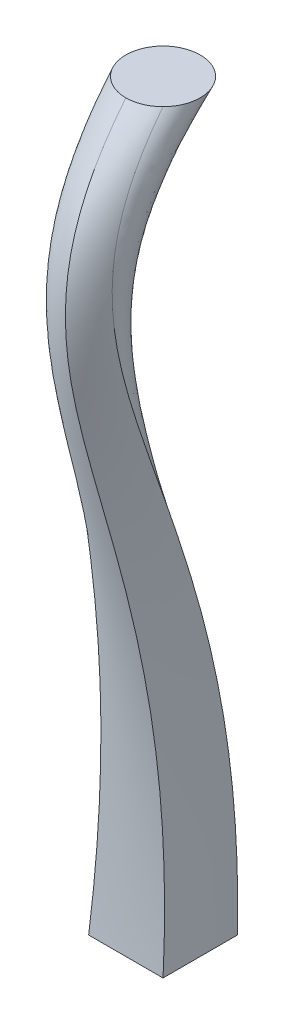
ISO-10303-21;
HEADER;
FILE_DESCRIPTION(('STEP AP214'),'2;1');
FILE_NAME('part.step','',(''),(''),'','','');
FILE_SCHEMA(('AUTOMOTIVE_DESIGN { 1 0 10303 214 1 1 1 1 }'));
ENDSEC;
DATA;
#1=APPLICATION_CONTEXT('core data for automotive mechanical design processes');
#2=APPLICATION_PROTOCOL_DEFINITION('international standard','automotive_design',2000,#1);
#3=PRODUCT_CONTEXT('',#1,'mechanical');
#4=PRODUCT('Part','Part','',(#3));
#5=PRODUCT_RELATED_PRODUCT_CATEGORY('part','',(#4));
#6=PRODUCT_DEFINITION_FORMATION('','',#4);
#7=PRODUCT_DEFINITION_CONTEXT('part definition',#1,'design');
#8=PRODUCT_DEFINITION('design','',#6,#7);
#9=PRODUCT_DEFINITION_SHAPE('','',#8);
#10=(LENGTH_UNIT() NAMED_UNIT(*) SI_UNIT(.MILLI.,.METRE.));
#11=(NAMED_UNIT(*) PLANE_ANGLE_UNIT() SI_UNIT($,.RADIAN.));
#12=(NAMED_UNIT(*) SI_UNIT($,.STERADIAN.) SOLID_ANGLE_UNIT());
#13=UNCERTAINTY_MEASURE_WITH_UNIT(LENGTH_MEASURE(1.E-05),#10,'distance_accuracy_value','');
#14=(GEOMETRIC_REPRESENTATION_CONTEXT(3) GLOBAL_UNCERTAINTY_ASSIGNED_CONTEXT((#13)) GLOBAL_UNIT_ASSIGNED_CONTEXT((#10,
#11,#12)) REPRESENTATION_CONTEXT('',''));
#15=CARTESIAN_POINT('',(0.,0.,0.));
#16=DIRECTION('',(0.,0.,1.));
#17=DIRECTION('',(1.,0.,0.));
#18=AXIS2_PLACEMENT_3D('',#15,#16,#17);
#19=CARTESIAN_POINT('',(0.,0.,0.));
#20=DIRECTION('',(0.,-1.,0.));
#21=DIRECTION('',(0.,0.,-1.));
#22=AXIS2_PLACEMENT_3D('',#19,#20,#21);
#23=PLANE('',#22);
#24=DIRECTION('',(0.,0.,1.));
#25=VECTOR('',#24,1.);
#26=CARTESIAN_POINT('',(-5.,0.,-5.));
#27=LINE('',#26,#25);
#28=CARTESIAN_POINT('',(-5.,0.,-5.));
#29=VERTEX_POINT('',#28);
#30=CARTESIAN_POINT('',(-5.,0.,5.));
#31=VERTEX_POINT('',#30);
#32=EDGE_CURVE('E224',#29,#31,#27,.T.);
#33=ORIENTED_EDGE('',*,*,#32,.F.);
#34=DIRECTION('',(-1.,0.,0.));
#35=VECTOR('',#34,1.);
#36=CARTESIAN_POINT('',(5.,0.,-5.));
#37=LINE('',#36,#35);
#38=CARTESIAN_POINT('',(5.,0.,-5.));
#39=VERTEX_POINT('',#38);
#40=EDGE_CURVE('E13',#39,#29,#37,.T.);
#41=ORIENTED_EDGE('',*,*,#40,.F.);
#42=DIRECTION('',(0.,0.,-1.));
#43=VECTOR('',#42,1.);
#44=CARTESIAN_POINT('',(5.,0.,-5.));
#45=LINE('',#44,#43);
#46=CARTESIAN_POINT('',(5.,0.,5.));
#47=VERTEX_POINT('',#46);
#48=EDGE_CURVE('E107',#47,#39,#45,.T.);
#49=ORIENTED_EDGE('',*,*,#48,.F.);
#50=DIRECTION('',(1.,0.,0.));
#51=VECTOR('',#50,1.);
#52=CARTESIAN_POINT('',(5.,0.,5.));
#53=LINE('',#52,#51);
#54=EDGE_CURVE('E297',#31,#47,#53,.T.);
#55=ORIENTED_EDGE('',*,*,#54,.F.);
#56=EDGE_LOOP('',(#33,#41,#49,#55));
#57=FACE_BOUND('',#56,.T.);
#58=ADVANCED_FACE('F97',(#57),#23,.T.);
#59=CARTESIAN_POINT('',(0.,100.,0.));
#60=DIRECTION('',(0.,1.,0.));
#61=DIRECTION('',(0.,0.,1.));
#62=AXIS2_PLACEMENT_3D('',#59,#60,#61);
#63=PLANE('',#62);
#64=CARTESIAN_POINT('',(0.,100.,0.));
#65=DIRECTION('',(0.,1.,0.));
#66=DIRECTION('',(0.,0.,1.));
#67=AXIS2_PLACEMENT_3D('',#64,#65,#66);
#68=CIRCLE('',#67,5.);
#69=CARTESIAN_POINT('',(3.53553390593274,100.,3.53553390593274));
#70=VERTEX_POINT('',#69);
#71=CARTESIAN_POINT('',(3.53553390593274,100.,-3.53553390593274));
#72=VERTEX_POINT('',#71);
#73=EDGE_CURVE('E154',#70,#72,#68,.T.);
#74=ORIENTED_EDGE('',*,*,#73,.T.);
#75=CARTESIAN_POINT('',(-3.53553390593274,100.,-3.53553390593274));
#76=VERTEX_POINT('',#75);
#77=EDGE_CURVE('E160',#72,#76,#68,.T.);
#78=ORIENTED_EDGE('',*,*,#77,.T.);
#79=CARTESIAN_POINT('',(0.,100.,5.));
#80=VERTEX_POINT('',#79);
#81=EDGE_CURVE('E167',#76,#80,#68,.T.);
#82=ORIENTED_EDGE('',*,*,#81,.T.);
#83=EDGE_CURVE('E147',#80,#70,#68,.T.);
#84=ORIENTED_EDGE('',*,*,#83,.T.);
#85=EDGE_LOOP('',(#74,#78,#82,#84));
#86=FACE_BOUND('',#85,.T.);
#87=ADVANCED_FACE('F165',(#86),#63,.T.);
#88=CARTESIAN_POINT('',(3.53553390593274,100.,3.53553390593274));
#89=CARTESIAN_POINT('',(4.02368927062183,74.7211062169845,24.367413158574));
#90=CARTESIAN_POINT('',(4.51184463531091,56.3040519453106,-6.78929293335356));
#91=CARTESIAN_POINT('',(5.,0.,-5.));
#92=CARTESIAN_POINT('',(3.304133755715,100.,3.76693405615047));
#93=CARTESIAN_POINT('',(3.86942250381,74.7211062169845,24.7994577031636));
#94=CARTESIAN_POINT('',(4.434711251905,56.3040519453106,-6.15660399439209));
#95=CARTESIAN_POINT('',(5.,0.,-4.16666666666667));
#96=CARTESIAN_POINT('',(2.79577081197192,100.,4.1841623596009));
#97=CARTESIAN_POINT('',(3.53051387464795,74.7211062169846,25.6331654610195));
#98=CARTESIAN_POINT('',(4.26525693732398,56.3040519453107,-4.90641678213084));
#99=CARTESIAN_POINT('',(5.00000000000001,0.,-2.5));
#100=CARTESIAN_POINT('',(1.92575275637179,99.9999999999998,4.64917842221016));
#101=CARTESIAN_POINT('',(2.95050183758119,74.7211062169843,26.776509502759));
#102=CARTESIAN_POINT('',(3.97525091879059,56.3040519453105,-3.08474476126109));
#103=CARTESIAN_POINT('',(4.99999999999999,0.,0.));
#104=CARTESIAN_POINT('',(0.981741078270542,100.,4.93555807784807));
#105=CARTESIAN_POINT('',(2.32116071884703,74.7211062169845,27.8007626065176));
#106=CARTESIAN_POINT('',(3.66058035942352,56.3040519453106,-1.32261820938179));
#107=CARTESIAN_POINT('',(5.00000000000001,0.,2.5));
#108=CARTESIAN_POINT('',(0.327249230773094,100.,5.));
#109=CARTESIAN_POINT('',(1.8848328205154,74.7211062169845,28.3992794435078));
#110=CARTESIAN_POINT('',(3.4424164102577,56.3040519453106,-0.190026457553365));
#111=CARTESIAN_POINT('',(5.,0.,4.16666666666667));
#112=CARTESIAN_POINT('',(0.,100.,5.));
#113=CARTESIAN_POINT('',(1.66666666666667,74.7211062169845,28.6770572212855));
#114=CARTESIAN_POINT('',(3.33333333333333,56.3040519453106,0.365529098002191));
#115=CARTESIAN_POINT('',(5.,0.,5.));
#116=B_SPLINE_SURFACE_WITH_KNOTS('',3,3,((#88,#89,#90,#91),(#92,#93,#94,#95),(#96,#97,#98,#99),
(#100,#101,#102,#103),(#104,#105,#106,#107),(#108,#109,#110,#111),(#112,#113,#114,#115)),
.UNSPECIFIED.,.F.,.F.,.F.,(4,1,1,1,4),(4,4),(0.8125,0.859375,0.90625,0.953125,1.),(0.,1.),.UNSPECIFIED.);
#117=CARTESIAN_POINT('',(0.,100.,5.));
#118=CARTESIAN_POINT('',(1.66666666666667,74.7211062169845,28.6770572212855));
#119=CARTESIAN_POINT('',(3.33333333333333,56.3040519453106,0.365529098002192));
#120=CARTESIAN_POINT('',(5.,0.,5.));
#121=B_SPLINE_CURVE_WITH_KNOTS('',3,(#117,#118,#119,#120),.UNSPECIFIED.,.F.,.F.,(4,4),(0.,1.),.UNSPECIFIED.);
#122=EDGE_CURVE('E152',#80,#47,#121,.T.);
#123=CARTESIAN_POINT('',(3.53553390593274,100.,3.53553390593274));
#124=CARTESIAN_POINT('',(4.02368927062183,74.7211062169845,24.367413158574));
#125=CARTESIAN_POINT('',(4.51184463531091,56.3040519453106,-6.78929293335356));
#126=CARTESIAN_POINT('',(5.,0.,-5.));
#127=B_SPLINE_CURVE_WITH_KNOTS('',3,(#123,#124,#125,#126),.UNSPECIFIED.,.F.,.F.,(4,4),(0.,1.),.UNSPECIFIED.);
#128=EDGE_CURVE('E142',#70,#39,#127,.T.);
#129=ORIENTED_EDGE('',*,*,#83,.F.);
#130=ORIENTED_EDGE('',*,*,#122,.T.);
#131=ORIENTED_EDGE('',*,*,#48,.T.);
#132=ORIENTED_EDGE('',*,*,#128,.F.);
#133=EDGE_LOOP('',(#129,#130,#131,#132));
#134=FACE_BOUND('',#133,.T.);
#135=ADVANCED_FACE('F144',(#134),#116,.T.);
#136=CARTESIAN_POINT('',(3.53553390593274,100.,-3.53553390593274));
#137=CARTESIAN_POINT('',(0.690355937288491,74.7211062169845,19.6533679506637));
#138=CARTESIAN_POINT('',(-2.15482203135575,56.3040519453106,-9.14631553730872));
#139=CARTESIAN_POINT('',(-5.,0.,-5.));
#140=CARTESIAN_POINT('',(3.99833420897964,100.,-3.07273360288584));
#141=CARTESIAN_POINT('',(1.27666725043087,74.7211062169845,19.9619014860283));
#142=CARTESIAN_POINT('',(-1.4449997081179,56.3040519453106,-8.99204876962642));
#143=CARTESIAN_POINT('',(-4.16666666666667,0.,-5.));
#144=CARTESIAN_POINT('',(4.73989736182588,100.,-1.96340426093218));
#145=CARTESIAN_POINT('',(2.32659824121726,74.7211062169846,20.7014543806641));
#146=CARTESIAN_POINT('',(-0.0867008793913722,56.3040519453107,-8.62227232230853));
#147=CARTESIAN_POINT('',(-2.5,0.,-5.));
#148=CARTESIAN_POINT('',(5.13028536592106,99.9999999999998,0.));
#149=CARTESIAN_POINT('',(3.42019024394738,74.7211062169843,22.0103905546189));
#150=CARTESIAN_POINT('',(1.71009512197369,56.3040519453105,-7.96780423533114));
#151=CARTESIAN_POINT('',(0.,0.,-5.));
#152=CARTESIAN_POINT('',(4.73989736182589,100.,1.96340426093217));
#153=CARTESIAN_POINT('',(3.99326490788393,74.7211062169845,23.3193267285736));
#154=CARTESIAN_POINT('',(3.24663245394197,56.3040519453106,-7.31333614835375));
#155=CARTESIAN_POINT('',(2.5,0.,-5.));
#156=CARTESIAN_POINT('',(3.99833420897964,100.,3.07273360288584));
#157=CARTESIAN_POINT('',(4.05444502820865,74.7211062169845,24.0588796232094));
#158=CARTESIAN_POINT('',(4.11055584743766,56.3040519453106,-6.94355970103586));
#159=CARTESIAN_POINT('',(4.16666666666667,0.,-5.));
#160=CARTESIAN_POINT('',(3.53553390593274,100.,3.53553390593274));
#161=CARTESIAN_POINT('',(4.02368927062183,74.7211062169845,24.367413158574));
#162=CARTESIAN_POINT('',(4.51184463531091,56.3040519453106,-6.78929293335356));
#163=CARTESIAN_POINT('',(5.,0.,-5.));
#164=B_SPLINE_SURFACE_WITH_KNOTS('',3,3,((#136,#137,#138,#139),(#140,#141,#142,#143),(#144,#145,
#146,#147),(#148,#149,#150,#151),(#152,#153,#154,#155),(#156,#157,#158,#159),(#160,#161,#162,
#163)),.UNSPECIFIED.,.F.,.F.,.F.,(4,1,1,1,4),(4,4),(0.5625,0.625,0.6875,0.75,0.8125),(0.,1.),.UNSPECIFIED.);
#165=CARTESIAN_POINT('',(3.53553390593274,100.,-3.53553390593274));
#166=CARTESIAN_POINT('',(0.690355937288491,74.7211062169845,19.6533679506637));
#167=CARTESIAN_POINT('',(-2.15482203135575,56.3040519453106,-9.14631553730872));
#168=CARTESIAN_POINT('',(-5.,0.,-5.));
#169=B_SPLINE_CURVE_WITH_KNOTS('',3,(#165,#166,#167,#168),.UNSPECIFIED.,.F.,.F.,(4,4),(0.,1.),.UNSPECIFIED.);
#170=EDGE_CURVE('E115',#72,#29,#169,.T.);
#171=ORIENTED_EDGE('',*,*,#73,.F.);
#172=ORIENTED_EDGE('',*,*,#128,.T.);
#173=ORIENTED_EDGE('',*,*,#40,.T.);
#174=ORIENTED_EDGE('',*,*,#170,.F.);
#175=EDGE_LOOP('',(#171,#172,#173,#174));
#176=FACE_BOUND('',#175,.T.);
#177=ADVANCED_FACE('F156',(#176),#164,.T.);
#178=CARTESIAN_POINT('',(-3.53553390593274,100.,-3.53553390593274));
#179=CARTESIAN_POINT('',(-4.02368927062182,74.7211062169845,22.986701283997));
#180=CARTESIAN_POINT('',(-4.51184463531091,56.3040519453106,-2.47964887064205));
#181=CARTESIAN_POINT('',(-5.,0.,5.));
#182=CARTESIAN_POINT('',(-3.07273360288584,100.,-3.99833420897964));
#183=CARTESIAN_POINT('',(-3.71515573525722,74.7211062169845,22.4003899708547));
#184=CARTESIAN_POINT('',(-4.35757786762861,56.3040519453106,-3.18947119387991));
#185=CARTESIAN_POINT('',(-5.,0.,4.16666666666667));
#186=CARTESIAN_POINT('',(-1.96340426093218,100.,-4.73989736182588));
#187=CARTESIAN_POINT('',(-2.97560284062145,74.7211062169844,21.3504589800683));
#188=CARTESIAN_POINT('',(-3.98780142031072,56.3040519453106,-4.54777002260643));
#189=CARTESIAN_POINT('',(-5.,0.,2.5));
#190=CARTESIAN_POINT('',(0.,100.,-5.13028536592107));
#191=CARTESIAN_POINT('',(-1.66666666666667,74.7211062169845,20.2568669773381));
#192=CARTESIAN_POINT('',(-3.33333333333333,56.3040519453106,-6.3445660239715));
#193=CARTESIAN_POINT('',(-5.,0.,0.));
#194=CARTESIAN_POINT('',(1.96340426093217,99.9999999999999,-4.73989736182589));
#195=CARTESIAN_POINT('',(-0.357730492711885,74.7211062169844,19.6837923134016));
#196=CARTESIAN_POINT('',(-2.67886524635594,56.3040519453106,-7.88110335593977));
#197=CARTESIAN_POINT('',(-5.,0.,-2.5));
#198=CARTESIAN_POINT('',(3.07273360288584,100.,-3.99833420897964));
#199=CARTESIAN_POINT('',(0.381822401923891,74.7211062169845,19.6226121930769));
#200=CARTESIAN_POINT('',(-2.30908879903805,56.3040519453106,-8.74502674943546));
#201=CARTESIAN_POINT('',(-5.,0.,-4.16666666666667));
#202=CARTESIAN_POINT('',(3.53553390593274,100.,-3.53553390593274));
#203=CARTESIAN_POINT('',(0.690355937288491,74.7211062169845,19.6533679506637));
#204=CARTESIAN_POINT('',(-2.15482203135575,56.3040519453106,-9.14631553730872));
#205=CARTESIAN_POINT('',(-5.,0.,-5.));
#206=B_SPLINE_SURFACE_WITH_KNOTS('',3,3,((#178,#179,#180,#181),(#182,#183,#184,#185),(#186,#187,
#188,#189),(#190,#191,#192,#193),(#194,#195,#196,#197),(#198,#199,#200,#201),(#202,#203,#204,
#205)),.UNSPECIFIED.,.F.,.F.,.F.,(4,1,1,1,4),(4,4),(0.3125,0.375,0.4375,0.5,0.5625),(0.,1.),.UNSPECIFIED.);
#207=CARTESIAN_POINT('',(-3.53553390593274,100.,-3.53553390593274));
#208=CARTESIAN_POINT('',(-4.02368927062182,74.7211062169845,22.986701283997));
#209=CARTESIAN_POINT('',(-4.51184463531091,56.3040519453106,-2.47964887064205));
#210=CARTESIAN_POINT('',(-5.,0.,5.));
#211=B_SPLINE_CURVE_WITH_KNOTS('',3,(#207,#208,#209,#210),.UNSPECIFIED.,.F.,.F.,(4,4),(0.,1.),.UNSPECIFIED.);
#212=EDGE_CURVE('E159',#76,#31,#211,.T.);
#213=ORIENTED_EDGE('',*,*,#77,.F.);
#214=ORIENTED_EDGE('',*,*,#170,.T.);
#215=ORIENTED_EDGE('',*,*,#32,.T.);
#216=ORIENTED_EDGE('',*,*,#212,.F.);
#217=EDGE_LOOP('',(#213,#214,#215,#216));
#218=FACE_BOUND('',#217,.T.);
#219=ADVANCED_FACE('F223',(#218),#206,.T.);
#220=CARTESIAN_POINT('',(0.,100.,5.));
#221=CARTESIAN_POINT('',(1.66666666666667,74.7211062169845,28.6770572212855));
#222=CARTESIAN_POINT('',(3.33333333333333,56.3040519453106,0.365529098002192));
#223=CARTESIAN_POINT('',(5.,0.,5.));
#224=CARTESIAN_POINT('',(-0.490873848023189,100.,5.));
#225=CARTESIAN_POINT('',(1.20052854576232,74.7211062169845,28.6770572212855));
#226=CARTESIAN_POINT('',(2.89193093954783,56.3040519453106,0.365529098002192));
#227=CARTESIAN_POINT('',(4.58333333333333,0.,5.));
#228=CARTESIAN_POINT('',(-1.47261053626716,99.9999999999999,4.85445817598424));
#229=CARTESIAN_POINT('',(0.26825964248856,74.7211062169844,28.5800293386084));
#230=CARTESIAN_POINT('',(2.00912982124428,56.3040519453106,0.317015156663606));
#231=CARTESIAN_POINT('',(3.75,0.,5.));
#232=CARTESIAN_POINT('',(-2.81834429562284,100.,4.21790562429867));
#233=CARTESIAN_POINT('',(-1.04556286374856,74.7211062169845,28.155660970818));
#234=CARTESIAN_POINT('',(0.727218568125722,56.3040519453106,0.104830972768417));
#235=CARTESIAN_POINT('',(2.5,0.,5.));
#236=CARTESIAN_POINT('',(-3.92138435241854,100.,3.21819313155499));
#237=CARTESIAN_POINT('',(-2.19758956827903,74.7211062169845,27.4891859756555));
#238=CARTESIAN_POINT('',(-0.473794784139511,56.3040519453106,-0.228406524812811));
#239=CARTESIAN_POINT('',(1.25,0.,5.));
#240=CARTESIAN_POINT('',(-4.68671188638344,100.,1.94129962627521));
#241=CARTESIAN_POINT('',(-3.12447459092229,74.7211062169845,26.6379236388023));
#242=CARTESIAN_POINT('',(-1.56223729546115,56.3040519453106,-0.654037693239408));
#243=CARTESIAN_POINT('',(0.,0.,5.));
#244=CARTESIAN_POINT('',(-5.04844365372447,99.9999999999999,0.49723128074346));
#245=CARTESIAN_POINT('',(-3.78229576914964,74.7211062169844,25.6752114084478));
#246=CARTESIAN_POINT('',(-2.51614788457482,56.3040519453106,-1.13539380841666));
#247=CARTESIAN_POINT('',(-1.25,0.,5.));
#248=CARTESIAN_POINT('',(-4.97538003249981,100.,-0.989639306193141));
#249=CARTESIAN_POINT('',(-4.15025335499988,74.7211062169845,24.6839643504901));
#250=CARTESIAN_POINT('',(-3.32512667749994,56.3040519453106,-1.63101733739552));
#251=CARTESIAN_POINT('',(-2.5,0.,5.));
#252=CARTESIAN_POINT('',(-4.47391319146619,100.,-2.39132739898366));
#253=CARTESIAN_POINT('',(-4.23260879431079,74.7211062169844,23.7495056219631));
#254=CARTESIAN_POINT('',(-3.99130439715539,56.3040519453106,-2.09824670165903));
#255=CARTESIAN_POINT('',(-3.75,0.,5.));
#256=CARTESIAN_POINT('',(-3.88263413257707,100.,-3.18843367928841));
#257=CARTESIAN_POINT('',(-4.11620053282916,74.7211062169845,23.2181014350933));
#258=CARTESIAN_POINT('',(-4.34976693308124,56.3040519453106,-2.36394879509394));
#259=CARTESIAN_POINT('',(-4.58333333333333,0.,5.));
#260=CARTESIAN_POINT('',(-3.53553390593274,100.,-3.53553390593274));
#261=CARTESIAN_POINT('',(-4.02368927062182,74.7211062169845,22.986701283997));
#262=CARTESIAN_POINT('',(-4.51184463531091,56.3040519453106,-2.47964887064205));
#263=CARTESIAN_POINT('',(-5.,0.,5.));
#264=B_SPLINE_SURFACE_WITH_KNOTS('',3,3,((#220,#221,#222,#223),(#224,#225,#226,#227),(#228,#229,
#230,#231),(#232,#233,#234,#235),(#236,#237,#238,#239),(#240,#241,#242,#243),(#244,#245,#246,
#247),(#248,#249,#250,#251),(#252,#253,#254,#255),(#256,#257,#258,#259),(#260,#261,#262,#263)),
.UNSPECIFIED.,.F.,.F.,.F.,(4,1,1,1,1,1,1,1,4),(4,4),(0.,0.0390625,0.078125,0.1171875,0.15625,
0.1953125,0.234375,0.2734375,0.3125),(0.,1.),.UNSPECIFIED.);
#265=ORIENTED_EDGE('',*,*,#81,.F.);
#266=ORIENTED_EDGE('',*,*,#212,.T.);
#267=ORIENTED_EDGE('',*,*,#54,.T.);
#268=ORIENTED_EDGE('',*,*,#122,.F.);
#269=EDGE_LOOP('',(#265,#266,#267,#268));
#270=FACE_BOUND('',#269,.T.);
#271=ADVANCED_FACE('F188',(#270),#264,.T.);
#272=CLOSED_SHELL('',(#58,#87,#135,#177,#219,#271));
#273=MANIFOLD_SOLID_BREP('B2',#272);
#274=ADVANCED_BREP_SHAPE_REPRESENTATION('',(#18,#273),#14);
#275=SHAPE_DEFINITION_REPRESENTATION(#9,#274);
ENDSEC;
END-ISO-10303-21;
